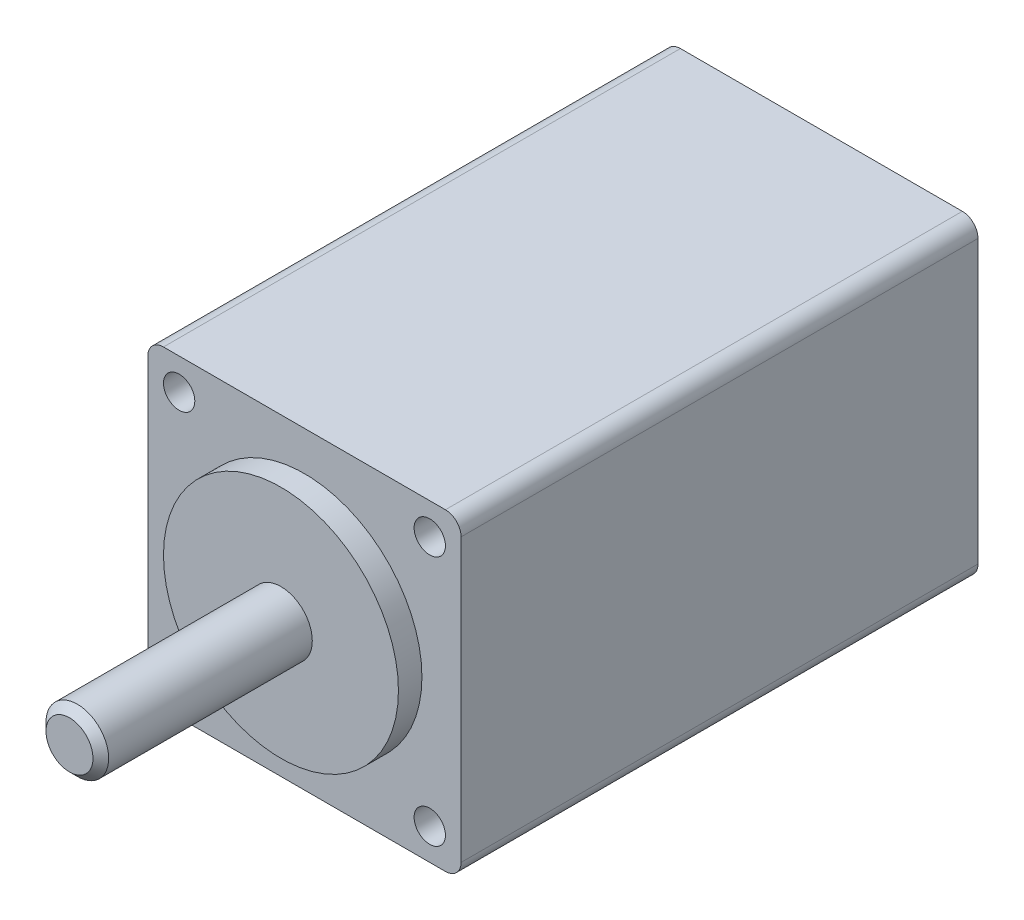
ISO-10303-21;
HEADER;
FILE_DESCRIPTION(('STEP AP214'),'2;1');
FILE_NAME('part.step','',(''),(''),'','','');
FILE_SCHEMA(('AUTOMOTIVE_DESIGN { 1 0 10303 214 1 1 1 1 }'));
ENDSEC;
DATA;
#1=APPLICATION_CONTEXT('core data for automotive mechanical design processes');
#2=APPLICATION_PROTOCOL_DEFINITION('international standard','automotive_design',2000,#1);
#3=PRODUCT_CONTEXT('',#1,'mechanical');
#4=PRODUCT('Part','Part','',(#3));
#5=PRODUCT_RELATED_PRODUCT_CATEGORY('part','',(#4));
#6=PRODUCT_DEFINITION_FORMATION('','',#4);
#7=PRODUCT_DEFINITION_CONTEXT('part definition',#1,'design');
#8=PRODUCT_DEFINITION('design','',#6,#7);
#9=PRODUCT_DEFINITION_SHAPE('','',#8);
#10=(LENGTH_UNIT() NAMED_UNIT(*) SI_UNIT(.MILLI.,.METRE.));
#11=(NAMED_UNIT(*) PLANE_ANGLE_UNIT() SI_UNIT($,.RADIAN.));
#12=(NAMED_UNIT(*) SI_UNIT($,.STERADIAN.) SOLID_ANGLE_UNIT());
#13=UNCERTAINTY_MEASURE_WITH_UNIT(LENGTH_MEASURE(1.E-05),#10,'distance_accuracy_value','');
#14=(GEOMETRIC_REPRESENTATION_CONTEXT(3) GLOBAL_UNCERTAINTY_ASSIGNED_CONTEXT((#13)) GLOBAL_UNIT_ASSIGNED_CONTEXT((#10,
#11,#12)) REPRESENTATION_CONTEXT('',''));
#15=CARTESIAN_POINT('',(0.,0.,0.));
#16=DIRECTION('',(0.,0.,1.));
#17=DIRECTION('',(1.,0.,0.));
#18=AXIS2_PLACEMENT_3D('',#15,#16,#17);
#19=CARTESIAN_POINT('',(0.,2.,15.));
#20=DIRECTION('',(0.,0.,-1.));
#21=DIRECTION('',(-1.,0.,0.));
#22=AXIS2_PLACEMENT_3D('',#19,#20,#21);
#23=PLANE('',#22);
#24=CARTESIAN_POINT('',(0.,0.,15.));
#25=DIRECTION('',(0.,0.,-1.));
#26=DIRECTION('',(-1.,0.,0.));
#27=AXIS2_PLACEMENT_3D('',#24,#25,#26);
#28=CIRCLE('',#27,1.49999999999999);
#29=CARTESIAN_POINT('',(-1.49999999999999,0.,15.));
#30=VERTEX_POINT('',#29);
#31=EDGE_CURVE('E11',#30,#30,#28,.F.);
#32=ORIENTED_EDGE('',*,*,#31,.T.);
#33=EDGE_LOOP('',(#32));
#34=FACE_BOUND('',#33,.T.);
#35=ADVANCED_FACE('F43',(#34),#23,.F.);
#36=CARTESIAN_POINT('',(0.,2.,-33.));
#37=DIRECTION('',(0.,0.,1.));
#38=DIRECTION('',(1.,0.,0.));
#39=AXIS2_PLACEMENT_3D('',#36,#37,#38);
#40=PLANE('',#39);
#41=CARTESIAN_POINT('',(0.,0.,-33.));
#42=DIRECTION('',(0.,0.,1.));
#43=DIRECTION('',(1.,0.,0.));
#44=AXIS2_PLACEMENT_3D('',#41,#42,#43);
#45=CIRCLE('',#44,1.49999999999999);
#46=CARTESIAN_POINT('',(1.49999999999999,0.,-33.));
#47=VERTEX_POINT('',#46);
#48=EDGE_CURVE('E50',#47,#47,#45,.F.);
#49=ORIENTED_EDGE('',*,*,#48,.T.);
#50=EDGE_LOOP('',(#49));
#51=FACE_BOUND('',#50,.T.);
#52=ADVANCED_FACE('F74',(#51),#40,.F.);
#53=CARTESIAN_POINT('',(0.,0.,32.857523652865));
#54=DIRECTION('',(0.,0.,1.));
#55=DIRECTION('',(1.,0.,0.));
#56=AXIS2_PLACEMENT_3D('',#53,#54,#55);
#57=CYLINDRICAL_SURFACE('',#56,2.);
#58=CARTESIAN_POINT('',(0.,0.,-32.5));
#59=DIRECTION('',(0.,0.,1.));
#60=DIRECTION('',(1.,0.,0.));
#61=AXIS2_PLACEMENT_3D('',#58,#59,#60);
#62=CIRCLE('',#61,2.);
#63=CARTESIAN_POINT('',(2.,0.,-32.5));
#64=VERTEX_POINT('',#63);
#65=EDGE_CURVE('E54',#64,#64,#62,.T.);
#66=ORIENTED_EDGE('',*,*,#65,.T.);
#67=EDGE_LOOP('',(#66));
#68=FACE_BOUND('',#67,.T.);
#69=CARTESIAN_POINT('',(0.,0.,14.5));
#70=DIRECTION('',(0.,0.,-1.));
#71=DIRECTION('',(-1.,0.,0.));
#72=AXIS2_PLACEMENT_3D('',#69,#70,#71);
#73=CIRCLE('',#72,2.);
#74=CARTESIAN_POINT('',(-2.,0.,14.5));
#75=VERTEX_POINT('',#74);
#76=EDGE_CURVE('E58',#75,#75,#73,.T.);
#77=ORIENTED_EDGE('',*,*,#76,.T.);
#78=EDGE_LOOP('',(#77));
#79=FACE_BOUND('',#78,.T.);
#80=ADVANCED_FACE('F64',(#68,#79),#57,.T.);
#81=CARTESIAN_POINT('',(0.,0.,-32.5));
#82=DIRECTION('',(0.,0.,1.));
#83=DIRECTION('',(1.,0.,0.));
#84=AXIS2_PLACEMENT_3D('',#81,#82,#83);
#85=CONICAL_SURFACE('',#84,2.,0.78539816339744);
#86=ORIENTED_EDGE('',*,*,#48,.F.);
#87=EDGE_LOOP('',(#86));
#88=FACE_BOUND('',#87,.T.);
#89=ORIENTED_EDGE('',*,*,#65,.F.);
#90=EDGE_LOOP('',(#89));
#91=FACE_BOUND('',#90,.T.);
#92=ADVANCED_FACE('F68',(#88,#91),#85,.T.);
#93=CARTESIAN_POINT('',(0.,0.,15.));
#94=DIRECTION('',(0.,0.,-1.));
#95=DIRECTION('',(-1.,0.,0.));
#96=AXIS2_PLACEMENT_3D('',#93,#94,#95);
#97=CONICAL_SURFACE('',#96,1.49999999999999,0.785398163397447);
#98=ORIENTED_EDGE('',*,*,#76,.F.);
#99=EDGE_LOOP('',(#98));
#100=FACE_BOUND('',#99,.T.);
#101=ORIENTED_EDGE('',*,*,#31,.F.);
#102=EDGE_LOOP('',(#101));
#103=FACE_BOUND('',#102,.T.);
#104=ADVANCED_FACE('F45',(#100,#103),#97,.T.);
#105=CLOSED_SHELL('',(#35,#52,#80,#92,#104));
#106=MANIFOLD_SOLID_BREP('B2',#105);
#107=CARTESIAN_POINT('',(-10.,-10.,0.));
#108=DIRECTION('',(0.,0.,1.));
#109=DIRECTION('',(1.,0.,0.));
#110=AXIS2_PLACEMENT_3D('',#107,#108,#109);
#111=PLANE('',#110);
#112=CARTESIAN_POINT('',(8.,-8.,0.));
#113=DIRECTION('',(0.,0.,1.));
#114=DIRECTION('',(1.,0.,0.));
#115=AXIS2_PLACEMENT_3D('',#112,#113,#114);
#116=CIRCLE('',#115,1.);
#117=CARTESIAN_POINT('',(9.,-8.,0.));
#118=VERTEX_POINT('',#117);
#119=EDGE_CURVE('E283',#118,#118,#116,.T.);
#120=ORIENTED_EDGE('',*,*,#119,.F.);
#121=EDGE_LOOP('',(#120));
#122=FACE_BOUND('',#121,.T.);
#123=CARTESIAN_POINT('',(-8.,-8.,0.));
#124=DIRECTION('',(0.,0.,1.));
#125=DIRECTION('',(1.,0.,0.));
#126=AXIS2_PLACEMENT_3D('',#123,#124,#125);
#127=CIRCLE('',#126,1.);
#128=CARTESIAN_POINT('',(-7.,-8.,0.));
#129=VERTEX_POINT('',#128);
#130=EDGE_CURVE('E277',#129,#129,#127,.T.);
#131=ORIENTED_EDGE('',*,*,#130,.F.);
#132=EDGE_LOOP('',(#131));
#133=FACE_BOUND('',#132,.T.);
#134=CARTESIAN_POINT('',(-8.,8.,0.));
#135=DIRECTION('',(0.,0.,1.));
#136=DIRECTION('',(1.,0.,0.));
#137=AXIS2_PLACEMENT_3D('',#134,#135,#136);
#138=CIRCLE('',#137,1.);
#139=CARTESIAN_POINT('',(-7.,8.,0.));
#140=VERTEX_POINT('',#139);
#141=EDGE_CURVE('E271',#140,#140,#138,.T.);
#142=ORIENTED_EDGE('',*,*,#141,.F.);
#143=EDGE_LOOP('',(#142));
#144=FACE_BOUND('',#143,.T.);
#145=CARTESIAN_POINT('',(8.,8.,0.));
#146=DIRECTION('',(0.,0.,1.));
#147=DIRECTION('',(1.,0.,0.));
#148=AXIS2_PLACEMENT_3D('',#145,#146,#147);
#149=CIRCLE('',#148,1.);
#150=CARTESIAN_POINT('',(9.,8.,0.));
#151=VERTEX_POINT('',#150);
#152=EDGE_CURVE('E265',#151,#151,#149,.T.);
#153=ORIENTED_EDGE('',*,*,#152,.F.);
#154=EDGE_LOOP('',(#153));
#155=FACE_BOUND('',#154,.T.);
#156=DIRECTION('',(0.,-1.,0.));
#157=VECTOR('',#156,1.);
#158=CARTESIAN_POINT('',(-10.,10.,0.));
#159=LINE('',#158,#157);
#160=CARTESIAN_POINT('',(-10.,9.,0.));
#161=VERTEX_POINT('',#160);
#162=CARTESIAN_POINT('',(-10.,-9.,0.));
#163=VERTEX_POINT('',#162);
#164=EDGE_CURVE('E183',#161,#163,#159,.T.);
#165=ORIENTED_EDGE('',*,*,#164,.T.);
#166=CARTESIAN_POINT('',(-9.00000000000001,-9.,0.));
#167=DIRECTION('',(0.,0.,1.));
#168=DIRECTION('',(1.,0.,0.));
#169=AXIS2_PLACEMENT_3D('',#166,#167,#168);
#170=CIRCLE('',#169,1.);
#171=CARTESIAN_POINT('',(-9.00000000000001,-10.,0.));
#172=VERTEX_POINT('',#171);
#173=EDGE_CURVE('E217',#163,#172,#170,.T.);
#174=ORIENTED_EDGE('',*,*,#173,.T.);
#175=DIRECTION('',(1.,0.,0.));
#176=VECTOR('',#175,1.);
#177=CARTESIAN_POINT('',(-10.,-10.,0.));
#178=LINE('',#177,#176);
#179=CARTESIAN_POINT('',(9.,-10.,0.));
#180=VERTEX_POINT('',#179);
#181=EDGE_CURVE('E200',#172,#180,#178,.T.);
#182=ORIENTED_EDGE('',*,*,#181,.T.);
#183=CARTESIAN_POINT('',(9.00000000000001,-9.,0.));
#184=DIRECTION('',(0.,0.,1.));
#185=DIRECTION('',(1.,0.,0.));
#186=AXIS2_PLACEMENT_3D('',#183,#184,#185);
#187=CIRCLE('',#186,1.);
#188=CARTESIAN_POINT('',(10.,-9.,0.));
#189=VERTEX_POINT('',#188);
#190=EDGE_CURVE('E215',#180,#189,#187,.T.);
#191=ORIENTED_EDGE('',*,*,#190,.T.);
#192=DIRECTION('',(0.,1.,0.));
#193=VECTOR('',#192,1.);
#194=CARTESIAN_POINT('',(10.,10.,0.));
#195=LINE('',#194,#193);
#196=CARTESIAN_POINT('',(10.,9.,0.));
#197=VERTEX_POINT('',#196);
#198=EDGE_CURVE('E243',#189,#197,#195,.T.);
#199=ORIENTED_EDGE('',*,*,#198,.T.);
#200=CARTESIAN_POINT('',(9.00000000000001,9.,0.));
#201=DIRECTION('',(0.,0.,1.));
#202=DIRECTION('',(1.,0.,0.));
#203=AXIS2_PLACEMENT_3D('',#200,#201,#202);
#204=CIRCLE('',#203,1.);
#205=CARTESIAN_POINT('',(9.,10.,0.));
#206=VERTEX_POINT('',#205);
#207=EDGE_CURVE('E190',#197,#206,#204,.T.);
#208=ORIENTED_EDGE('',*,*,#207,.T.);
#209=DIRECTION('',(-1.,0.,0.));
#210=VECTOR('',#209,1.);
#211=CARTESIAN_POINT('',(-10.,10.,0.));
#212=LINE('',#211,#210);
#213=CARTESIAN_POINT('',(-9.00000000000001,10.,0.));
#214=VERTEX_POINT('',#213);
#215=EDGE_CURVE('E185',#206,#214,#212,.T.);
#216=ORIENTED_EDGE('',*,*,#215,.T.);
#217=CARTESIAN_POINT('',(-9.00000000000001,9.,0.));
#218=DIRECTION('',(0.,0.,1.));
#219=DIRECTION('',(1.,0.,0.));
#220=AXIS2_PLACEMENT_3D('',#217,#218,#219);
#221=CIRCLE('',#220,1.);
#222=EDGE_CURVE('E180',#214,#161,#221,.T.);
#223=ORIENTED_EDGE('',*,*,#222,.T.);
#224=EDGE_LOOP('',(#165,#174,#182,#191,#199,#208,#216,#223));
#225=FACE_BOUND('',#224,.T.);
#226=CARTESIAN_POINT('',(0.,0.,0.));
#227=DIRECTION('',(0.,0.,1.));
#228=DIRECTION('',(1.,0.,0.));
#229=AXIS2_PLACEMENT_3D('',#226,#227,#228);
#230=CIRCLE('',#229,7.5);
#231=CARTESIAN_POINT('',(7.5,0.,0.));
#232=VERTEX_POINT('',#231);
#233=EDGE_CURVE('E253',#232,#232,#230,.T.);
#234=ORIENTED_EDGE('',*,*,#233,.F.);
#235=EDGE_LOOP('',(#234));
#236=FACE_BOUND('',#235,.T.);
#237=ADVANCED_FACE('F114',(#122,#133,#144,#155,#225,#236),#111,.T.);
#238=CARTESIAN_POINT('',(-10.,10.,-33.));
#239=DIRECTION('',(-1.,0.,0.));
#240=DIRECTION('',(0.,0.,1.));
#241=AXIS2_PLACEMENT_3D('',#238,#239,#240);
#242=PLANE('',#241);
#243=DIRECTION('',(0.,-1.,0.));
#244=VECTOR('',#243,1.);
#245=CARTESIAN_POINT('',(-10.,10.,-33.));
#246=LINE('',#245,#244);
#247=CARTESIAN_POINT('',(-10.,9.,-33.));
#248=VERTEX_POINT('',#247);
#249=CARTESIAN_POINT('',(-10.,-9.,-33.));
#250=VERTEX_POINT('',#249);
#251=EDGE_CURVE('E245',#248,#250,#246,.T.);
#252=ORIENTED_EDGE('',*,*,#251,.T.);
#253=DIRECTION('',(0.,0.,1.));
#254=VECTOR('',#253,1.);
#255=CARTESIAN_POINT('',(-10.,-9.,-33.));
#256=LINE('',#255,#254);
#257=EDGE_CURVE('E191',#250,#163,#256,.T.);
#258=ORIENTED_EDGE('',*,*,#257,.T.);
#259=ORIENTED_EDGE('',*,*,#164,.F.);
#260=DIRECTION('',(0.,0.,1.));
#261=VECTOR('',#260,1.);
#262=CARTESIAN_POINT('',(-10.,9.,-33.));
#263=LINE('',#262,#261);
#264=EDGE_CURVE('E197',#161,#248,#263,.F.);
#265=ORIENTED_EDGE('',*,*,#264,.T.);
#266=EDGE_LOOP('',(#252,#258,#259,#265));
#267=FACE_BOUND('',#266,.T.);
#268=ADVANCED_FACE('F196',(#267),#242,.T.);
#269=CARTESIAN_POINT('',(-10.,10.,-33.));
#270=DIRECTION('',(0.,1.,0.));
#271=DIRECTION('',(0.,0.,1.));
#272=AXIS2_PLACEMENT_3D('',#269,#270,#271);
#273=PLANE('',#272);
#274=ORIENTED_EDGE('',*,*,#215,.F.);
#275=DIRECTION('',(0.,0.,1.));
#276=VECTOR('',#275,1.);
#277=CARTESIAN_POINT('',(9.00000000000001,10.,-33.));
#278=LINE('',#277,#276);
#279=CARTESIAN_POINT('',(9.,10.,-33.));
#280=VERTEX_POINT('',#279);
#281=EDGE_CURVE('E41',#206,#280,#278,.F.);
#282=ORIENTED_EDGE('',*,*,#281,.T.);
#283=DIRECTION('',(-1.,0.,0.));
#284=VECTOR('',#283,1.);
#285=CARTESIAN_POINT('',(-10.,10.,-33.));
#286=LINE('',#285,#284);
#287=CARTESIAN_POINT('',(-9.00000000000001,10.,-33.));
#288=VERTEX_POINT('',#287);
#289=EDGE_CURVE('E205',#280,#288,#286,.T.);
#290=ORIENTED_EDGE('',*,*,#289,.T.);
#291=DIRECTION('',(0.,0.,1.));
#292=VECTOR('',#291,1.);
#293=CARTESIAN_POINT('',(-9.00000000000001,10.,-33.));
#294=LINE('',#293,#292);
#295=EDGE_CURVE('E122',#288,#214,#294,.T.);
#296=ORIENTED_EDGE('',*,*,#295,.T.);
#297=EDGE_LOOP('',(#274,#282,#290,#296));
#298=FACE_BOUND('',#297,.T.);
#299=ADVANCED_FACE('F234',(#298),#273,.T.);
#300=CARTESIAN_POINT('',(10.,10.,-33.));
#301=DIRECTION('',(1.,0.,0.));
#302=DIRECTION('',(0.,0.,-1.));
#303=AXIS2_PLACEMENT_3D('',#300,#301,#302);
#304=PLANE('',#303);
#305=ORIENTED_EDGE('',*,*,#198,.F.);
#306=DIRECTION('',(0.,0.,1.));
#307=VECTOR('',#306,1.);
#308=CARTESIAN_POINT('',(10.,-9.,-33.));
#309=LINE('',#308,#307);
#310=CARTESIAN_POINT('',(10.,-9.,-33.));
#311=VERTEX_POINT('',#310);
#312=EDGE_CURVE('E136',#189,#311,#309,.F.);
#313=ORIENTED_EDGE('',*,*,#312,.T.);
#314=DIRECTION('',(0.,1.,0.));
#315=VECTOR('',#314,1.);
#316=CARTESIAN_POINT('',(10.,10.,-33.));
#317=LINE('',#316,#315);
#318=CARTESIAN_POINT('',(10.,9.,-33.));
#319=VERTEX_POINT('',#318);
#320=EDGE_CURVE('E209',#311,#319,#317,.T.);
#321=ORIENTED_EDGE('',*,*,#320,.T.);
#322=DIRECTION('',(0.,0.,1.));
#323=VECTOR('',#322,1.);
#324=CARTESIAN_POINT('',(10.,9.,-33.));
#325=LINE('',#324,#323);
#326=EDGE_CURVE('E230',#319,#197,#325,.T.);
#327=ORIENTED_EDGE('',*,*,#326,.T.);
#328=EDGE_LOOP('',(#305,#313,#321,#327));
#329=FACE_BOUND('',#328,.T.);
#330=ADVANCED_FACE('F242',(#329),#304,.T.);
#331=CARTESIAN_POINT('',(-10.,-10.,-33.));
#332=DIRECTION('',(0.,-1.,0.));
#333=DIRECTION('',(0.,0.,-1.));
#334=AXIS2_PLACEMENT_3D('',#331,#332,#333);
#335=PLANE('',#334);
#336=ORIENTED_EDGE('',*,*,#181,.F.);
#337=DIRECTION('',(0.,0.,1.));
#338=VECTOR('',#337,1.);
#339=CARTESIAN_POINT('',(-9.00000000000001,-10.,-33.));
#340=LINE('',#339,#338);
#341=CARTESIAN_POINT('',(-9.00000000000001,-10.,-33.));
#342=VERTEX_POINT('',#341);
#343=EDGE_CURVE('E222',#172,#342,#340,.F.);
#344=ORIENTED_EDGE('',*,*,#343,.T.);
#345=DIRECTION('',(1.,0.,0.));
#346=VECTOR('',#345,1.);
#347=CARTESIAN_POINT('',(-10.,-10.,-33.));
#348=LINE('',#347,#346);
#349=CARTESIAN_POINT('',(9.,-10.,-33.));
#350=VERTEX_POINT('',#349);
#351=EDGE_CURVE('E249',#342,#350,#348,.T.);
#352=ORIENTED_EDGE('',*,*,#351,.T.);
#353=DIRECTION('',(0.,0.,1.));
#354=VECTOR('',#353,1.);
#355=CARTESIAN_POINT('',(9.00000000000001,-10.,-33.));
#356=LINE('',#355,#354);
#357=EDGE_CURVE('E219',#350,#180,#356,.T.);
#358=ORIENTED_EDGE('',*,*,#357,.T.);
#359=EDGE_LOOP('',(#336,#344,#352,#358));
#360=FACE_BOUND('',#359,.T.);
#361=ADVANCED_FACE('F336',(#360),#335,.T.);
#362=CARTESIAN_POINT('',(-10.,-10.,-33.));
#363=DIRECTION('',(0.,0.,1.));
#364=DIRECTION('',(1.,0.,0.));
#365=AXIS2_PLACEMENT_3D('',#362,#363,#364);
#366=PLANE('',#365);
#367=CARTESIAN_POINT('',(0.,0.,-33.));
#368=DIRECTION('',(0.,0.,1.));
#369=DIRECTION('',(1.,0.,0.));
#370=AXIS2_PLACEMENT_3D('',#367,#368,#369);
#371=CIRCLE('',#370,2.);
#372=CARTESIAN_POINT('',(2.,0.,-33.));
#373=VERTEX_POINT('',#372);
#374=EDGE_CURVE('E256',#373,#373,#371,.T.);
#375=ORIENTED_EDGE('',*,*,#374,.T.);
#376=EDGE_LOOP('',(#375));
#377=FACE_BOUND('',#376,.T.);
#378=ORIENTED_EDGE('',*,*,#351,.F.);
#379=CARTESIAN_POINT('',(-9.00000000000001,-9.,-33.));
#380=DIRECTION('',(0.,0.,1.));
#381=DIRECTION('',(1.,0.,0.));
#382=AXIS2_PLACEMENT_3D('',#379,#380,#381);
#383=CIRCLE('',#382,1.);
#384=EDGE_CURVE('E228',#342,#250,#383,.F.);
#385=ORIENTED_EDGE('',*,*,#384,.T.);
#386=ORIENTED_EDGE('',*,*,#251,.F.);
#387=CARTESIAN_POINT('',(-9.00000000000001,9.,-33.));
#388=DIRECTION('',(0.,0.,1.));
#389=DIRECTION('',(1.,0.,0.));
#390=AXIS2_PLACEMENT_3D('',#387,#388,#389);
#391=CIRCLE('',#390,1.);
#392=EDGE_CURVE('E204',#248,#288,#391,.F.);
#393=ORIENTED_EDGE('',*,*,#392,.T.);
#394=ORIENTED_EDGE('',*,*,#289,.F.);
#395=CARTESIAN_POINT('',(9.00000000000001,9.,-33.));
#396=DIRECTION('',(0.,0.,1.));
#397=DIRECTION('',(1.,0.,0.));
#398=AXIS2_PLACEMENT_3D('',#395,#396,#397);
#399=CIRCLE('',#398,1.);
#400=EDGE_CURVE('E129',#280,#319,#399,.F.);
#401=ORIENTED_EDGE('',*,*,#400,.T.);
#402=ORIENTED_EDGE('',*,*,#320,.F.);
#403=CARTESIAN_POINT('',(9.00000000000001,-9.,-33.));
#404=DIRECTION('',(0.,0.,1.));
#405=DIRECTION('',(1.,0.,0.));
#406=AXIS2_PLACEMENT_3D('',#403,#404,#405);
#407=CIRCLE('',#406,1.);
#408=EDGE_CURVE('E226',#311,#350,#407,.F.);
#409=ORIENTED_EDGE('',*,*,#408,.T.);
#410=EDGE_LOOP('',(#378,#385,#386,#393,#394,#401,#402,#409));
#411=FACE_BOUND('',#410,.T.);
#412=ADVANCED_FACE('F237',(#377,#411),#366,.F.);
#413=CARTESIAN_POINT('',(0.,0.,1.5));
#414=DIRECTION('',(0.,0.,-1.));
#415=DIRECTION('',(-1.,0.,0.));
#416=AXIS2_PLACEMENT_3D('',#413,#414,#415);
#417=CYLINDRICAL_SURFACE('',#416,7.5);
#418=CARTESIAN_POINT('',(0.,0.,1.5));
#419=DIRECTION('',(0.,0.,1.));
#420=DIRECTION('',(1.,0.,0.));
#421=AXIS2_PLACEMENT_3D('',#418,#419,#420);
#422=CIRCLE('',#421,7.5);
#423=CARTESIAN_POINT('',(7.5,0.,1.5));
#424=VERTEX_POINT('',#423);
#425=EDGE_CURVE('E201',#424,#424,#422,.T.);
#426=ORIENTED_EDGE('',*,*,#425,.F.);
#427=EDGE_LOOP('',(#426));
#428=FACE_BOUND('',#427,.T.);
#429=ORIENTED_EDGE('',*,*,#233,.T.);
#430=EDGE_LOOP('',(#429));
#431=FACE_BOUND('',#430,.T.);
#432=ADVANCED_FACE('F330',(#428,#431),#417,.T.);
#433=CARTESIAN_POINT('',(0.,0.,1.5));
#434=DIRECTION('',(0.,0.,1.));
#435=DIRECTION('',(1.,0.,0.));
#436=AXIS2_PLACEMENT_3D('',#433,#434,#435);
#437=PLANE('',#436);
#438=CARTESIAN_POINT('',(0.,0.,1.5));
#439=DIRECTION('',(0.,0.,1.));
#440=DIRECTION('',(1.,0.,0.));
#441=AXIS2_PLACEMENT_3D('',#438,#439,#440);
#442=CIRCLE('',#441,2.);
#443=CARTESIAN_POINT('',(2.,0.,1.5));
#444=VERTEX_POINT('',#443);
#445=EDGE_CURVE('E259',#444,#444,#442,.T.);
#446=ORIENTED_EDGE('',*,*,#445,.F.);
#447=EDGE_LOOP('',(#446));
#448=FACE_BOUND('',#447,.T.);
#449=ORIENTED_EDGE('',*,*,#425,.T.);
#450=EDGE_LOOP('',(#449));
#451=FACE_BOUND('',#450,.T.);
#452=ADVANCED_FACE('F326',(#448,#451),#437,.T.);
#453=CARTESIAN_POINT('',(0.,0.,-33.));
#454=DIRECTION('',(0.,0.,1.));
#455=DIRECTION('',(1.,0.,0.));
#456=AXIS2_PLACEMENT_3D('',#453,#454,#455);
#457=CYLINDRICAL_SURFACE('',#456,2.);
#458=ORIENTED_EDGE('',*,*,#374,.F.);
#459=EDGE_LOOP('',(#458));
#460=FACE_BOUND('',#459,.T.);
#461=ORIENTED_EDGE('',*,*,#445,.T.);
#462=EDGE_LOOP('',(#461));
#463=FACE_BOUND('',#462,.T.);
#464=ADVANCED_FACE('F322',(#460,#463),#457,.F.);
#465=CARTESIAN_POINT('',(-9.00000000000001,-9.,-33.));
#466=DIRECTION('',(0.,0.,1.));
#467=DIRECTION('',(1.,0.,0.));
#468=AXIS2_PLACEMENT_3D('',#465,#466,#467);
#469=CYLINDRICAL_SURFACE('',#468,1.);
#470=ORIENTED_EDGE('',*,*,#384,.F.);
#471=ORIENTED_EDGE('',*,*,#343,.F.);
#472=ORIENTED_EDGE('',*,*,#173,.F.);
#473=ORIENTED_EDGE('',*,*,#257,.F.);
#474=EDGE_LOOP('',(#470,#471,#472,#473));
#475=FACE_BOUND('',#474,.T.);
#476=ADVANCED_FACE('F325',(#475),#469,.T.);
#477=CARTESIAN_POINT('',(9.00000000000001,-9.,-33.));
#478=DIRECTION('',(0.,0.,1.));
#479=DIRECTION('',(1.,0.,0.));
#480=AXIS2_PLACEMENT_3D('',#477,#478,#479);
#481=CYLINDRICAL_SURFACE('',#480,1.);
#482=ORIENTED_EDGE('',*,*,#408,.F.);
#483=ORIENTED_EDGE('',*,*,#312,.F.);
#484=ORIENTED_EDGE('',*,*,#190,.F.);
#485=ORIENTED_EDGE('',*,*,#357,.F.);
#486=EDGE_LOOP('',(#482,#483,#484,#485));
#487=FACE_BOUND('',#486,.T.);
#488=ADVANCED_FACE('F350',(#487),#481,.T.);
#489=CARTESIAN_POINT('',(9.00000000000001,9.,-33.));
#490=DIRECTION('',(0.,0.,1.));
#491=DIRECTION('',(1.,0.,0.));
#492=AXIS2_PLACEMENT_3D('',#489,#490,#491);
#493=CYLINDRICAL_SURFACE('',#492,1.);
#494=ORIENTED_EDGE('',*,*,#400,.F.);
#495=ORIENTED_EDGE('',*,*,#281,.F.);
#496=ORIENTED_EDGE('',*,*,#207,.F.);
#497=ORIENTED_EDGE('',*,*,#326,.F.);
#498=EDGE_LOOP('',(#494,#495,#496,#497));
#499=FACE_BOUND('',#498,.T.);
#500=ADVANCED_FACE('F240',(#499),#493,.T.);
#501=CARTESIAN_POINT('',(-9.00000000000001,9.,-33.));
#502=DIRECTION('',(0.,0.,1.));
#503=DIRECTION('',(1.,0.,0.));
#504=AXIS2_PLACEMENT_3D('',#501,#502,#503);
#505=CYLINDRICAL_SURFACE('',#504,1.);
#506=ORIENTED_EDGE('',*,*,#392,.F.);
#507=ORIENTED_EDGE('',*,*,#264,.F.);
#508=ORIENTED_EDGE('',*,*,#222,.F.);
#509=ORIENTED_EDGE('',*,*,#295,.F.);
#510=EDGE_LOOP('',(#506,#507,#508,#509));
#511=FACE_BOUND('',#510,.T.);
#512=ADVANCED_FACE('F116',(#511),#505,.T.);
#513=CARTESIAN_POINT('',(8.,8.,-3.));
#514=DIRECTION('',(0.,0.,1.));
#515=DIRECTION('',(1.,0.,0.));
#516=AXIS2_PLACEMENT_3D('',#513,#514,#515);
#517=CYLINDRICAL_SURFACE('',#516,1.);
#518=CARTESIAN_POINT('',(8.,8.,-3.));
#519=DIRECTION('',(0.,0.,1.));
#520=DIRECTION('',(1.,0.,0.));
#521=AXIS2_PLACEMENT_3D('',#518,#519,#520);
#522=CIRCLE('',#521,1.);
#523=CARTESIAN_POINT('',(9.,8.,-3.));
#524=VERTEX_POINT('',#523);
#525=EDGE_CURVE('E262',#524,#524,#522,.T.);
#526=ORIENTED_EDGE('',*,*,#525,.F.);
#527=EDGE_LOOP('',(#526));
#528=FACE_BOUND('',#527,.T.);
#529=ORIENTED_EDGE('',*,*,#152,.T.);
#530=EDGE_LOOP('',(#529));
#531=FACE_BOUND('',#530,.T.);
#532=ADVANCED_FACE('F307',(#528,#531),#517,.F.);
#533=CARTESIAN_POINT('',(8.,8.,-3.));
#534=DIRECTION('',(0.,0.,1.));
#535=DIRECTION('',(1.,0.,0.));
#536=AXIS2_PLACEMENT_3D('',#533,#534,#535);
#537=PLANE('',#536);
#538=ORIENTED_EDGE('',*,*,#525,.T.);
#539=EDGE_LOOP('',(#538));
#540=FACE_BOUND('',#539,.T.);
#541=ADVANCED_FACE('F309',(#540),#537,.T.);
#542=CARTESIAN_POINT('',(-8.,8.,-3.));
#543=DIRECTION('',(0.,0.,1.));
#544=DIRECTION('',(1.,0.,0.));
#545=AXIS2_PLACEMENT_3D('',#542,#543,#544);
#546=CYLINDRICAL_SURFACE('',#545,1.);
#547=CARTESIAN_POINT('',(-8.,8.,-3.));
#548=DIRECTION('',(0.,0.,1.));
#549=DIRECTION('',(1.,0.,0.));
#550=AXIS2_PLACEMENT_3D('',#547,#548,#549);
#551=CIRCLE('',#550,1.);
#552=CARTESIAN_POINT('',(-7.,8.,-3.));
#553=VERTEX_POINT('',#552);
#554=EDGE_CURVE('E268',#553,#553,#551,.T.);
#555=ORIENTED_EDGE('',*,*,#554,.F.);
#556=EDGE_LOOP('',(#555));
#557=FACE_BOUND('',#556,.T.);
#558=ORIENTED_EDGE('',*,*,#141,.T.);
#559=EDGE_LOOP('',(#558));
#560=FACE_BOUND('',#559,.T.);
#561=ADVANCED_FACE('F316',(#557,#560),#546,.F.);
#562=CARTESIAN_POINT('',(-8.,8.,-3.));
#563=DIRECTION('',(0.,0.,1.));
#564=DIRECTION('',(1.,0.,0.));
#565=AXIS2_PLACEMENT_3D('',#562,#563,#564);
#566=PLANE('',#565);
#567=ORIENTED_EDGE('',*,*,#554,.T.);
#568=EDGE_LOOP('',(#567));
#569=FACE_BOUND('',#568,.T.);
#570=ADVANCED_FACE('F393',(#569),#566,.T.);
#571=CARTESIAN_POINT('',(-8.,-8.,-3.));
#572=DIRECTION('',(0.,0.,1.));
#573=DIRECTION('',(1.,0.,0.));
#574=AXIS2_PLACEMENT_3D('',#571,#572,#573);
#575=CYLINDRICAL_SURFACE('',#574,1.);
#576=CARTESIAN_POINT('',(-8.,-8.,-3.));
#577=DIRECTION('',(0.,0.,1.));
#578=DIRECTION('',(1.,0.,0.));
#579=AXIS2_PLACEMENT_3D('',#576,#577,#578);
#580=CIRCLE('',#579,1.);
#581=CARTESIAN_POINT('',(-7.,-8.,-3.));
#582=VERTEX_POINT('',#581);
#583=EDGE_CURVE('E274',#582,#582,#580,.T.);
#584=ORIENTED_EDGE('',*,*,#583,.F.);
#585=EDGE_LOOP('',(#584));
#586=FACE_BOUND('',#585,.T.);
#587=ORIENTED_EDGE('',*,*,#130,.T.);
#588=EDGE_LOOP('',(#587));
#589=FACE_BOUND('',#588,.T.);
#590=ADVANCED_FACE('F402',(#586,#589),#575,.F.);
#591=CARTESIAN_POINT('',(-8.,-8.,-3.));
#592=DIRECTION('',(0.,0.,1.));
#593=DIRECTION('',(1.,0.,0.));
#594=AXIS2_PLACEMENT_3D('',#591,#592,#593);
#595=PLANE('',#594);
#596=ORIENTED_EDGE('',*,*,#583,.T.);
#597=EDGE_LOOP('',(#596));
#598=FACE_BOUND('',#597,.T.);
#599=ADVANCED_FACE('F294',(#598),#595,.T.);
#600=CARTESIAN_POINT('',(8.,-8.,-3.));
#601=DIRECTION('',(0.,0.,1.));
#602=DIRECTION('',(1.,0.,0.));
#603=AXIS2_PLACEMENT_3D('',#600,#601,#602);
#604=CYLINDRICAL_SURFACE('',#603,1.);
#605=CARTESIAN_POINT('',(8.,-8.,-3.));
#606=DIRECTION('',(0.,0.,1.));
#607=DIRECTION('',(1.,0.,0.));
#608=AXIS2_PLACEMENT_3D('',#605,#606,#607);
#609=CIRCLE('',#608,1.);
#610=CARTESIAN_POINT('',(9.,-8.,-3.));
#611=VERTEX_POINT('',#610);
#612=EDGE_CURVE('E280',#611,#611,#609,.T.);
#613=ORIENTED_EDGE('',*,*,#612,.F.);
#614=EDGE_LOOP('',(#613));
#615=FACE_BOUND('',#614,.T.);
#616=ORIENTED_EDGE('',*,*,#119,.T.);
#617=EDGE_LOOP('',(#616));
#618=FACE_BOUND('',#617,.T.);
#619=ADVANCED_FACE('F291',(#615,#618),#604,.F.);
#620=CARTESIAN_POINT('',(8.,-8.,-3.));
#621=DIRECTION('',(0.,0.,1.));
#622=DIRECTION('',(1.,0.,0.));
#623=AXIS2_PLACEMENT_3D('',#620,#621,#622);
#624=PLANE('',#623);
#625=ORIENTED_EDGE('',*,*,#612,.T.);
#626=EDGE_LOOP('',(#625));
#627=FACE_BOUND('',#626,.T.);
#628=ADVANCED_FACE('F289',(#627),#624,.T.);
#629=CLOSED_SHELL('',(#237,#268,#299,#330,#361,#412,#432,#452,#464,#476,#488,#500,#512,#532,
#541,#561,#570,#590,#599,#619,#628));
#630=MANIFOLD_SOLID_BREP('B6',#629);
#631=ADVANCED_BREP_SHAPE_REPRESENTATION('',(#18,#106,#630),#14);
#632=SHAPE_DEFINITION_REPRESENTATION(#9,#631);
ENDSEC;
END-ISO-10303-21;
